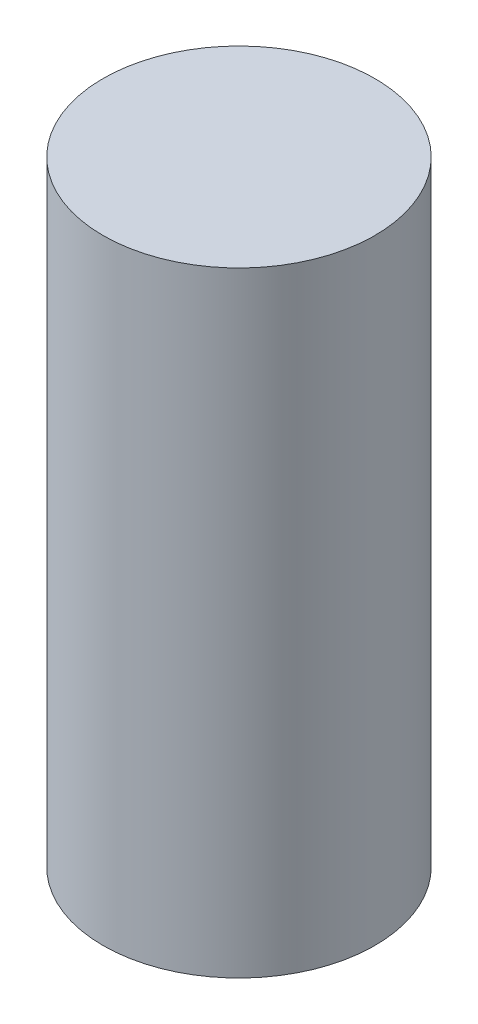
ISO-10303-21;
HEADER;
FILE_DESCRIPTION(('STEP AP214'),'2;1');
FILE_NAME('part.step','',(''),(''),'','','');
FILE_SCHEMA(('AUTOMOTIVE_DESIGN { 1 0 10303 214 1 1 1 1 }'));
ENDSEC;
DATA;
#1=APPLICATION_CONTEXT('core data for automotive mechanical design processes');
#2=APPLICATION_PROTOCOL_DEFINITION('international standard','automotive_design',2000,#1);
#3=PRODUCT_CONTEXT('',#1,'mechanical');
#4=PRODUCT('Part','Part','',(#3));
#5=PRODUCT_RELATED_PRODUCT_CATEGORY('part','',(#4));
#6=PRODUCT_DEFINITION_FORMATION('','',#4);
#7=PRODUCT_DEFINITION_CONTEXT('part definition',#1,'design');
#8=PRODUCT_DEFINITION('design','',#6,#7);
#9=PRODUCT_DEFINITION_SHAPE('','',#8);
#10=(LENGTH_UNIT() NAMED_UNIT(*) SI_UNIT(.MILLI.,.METRE.));
#11=(NAMED_UNIT(*) PLANE_ANGLE_UNIT() SI_UNIT($,.RADIAN.));
#12=(NAMED_UNIT(*) SI_UNIT($,.STERADIAN.) SOLID_ANGLE_UNIT());
#13=UNCERTAINTY_MEASURE_WITH_UNIT(LENGTH_MEASURE(1.E-05),#10,'distance_accuracy_value','');
#14=(GEOMETRIC_REPRESENTATION_CONTEXT(3) GLOBAL_UNCERTAINTY_ASSIGNED_CONTEXT((#13)) GLOBAL_UNIT_ASSIGNED_CONTEXT((#10,
#11,#12)) REPRESENTATION_CONTEXT('',''));
#15=CARTESIAN_POINT('',(0.,0.,0.));
#16=DIRECTION('',(0.,0.,1.));
#17=DIRECTION('',(1.,0.,0.));
#18=AXIS2_PLACEMENT_3D('',#15,#16,#17);
#19=CARTESIAN_POINT('',(0.,17.98,0.));
#20=DIRECTION('',(0.,-1.,0.));
#21=DIRECTION('',(0.,0.,-1.));
#22=AXIS2_PLACEMENT_3D('',#19,#20,#21);
#23=CYLINDRICAL_SURFACE('',#22,3.975);
#24=CARTESIAN_POINT('',(0.,17.98,0.));
#25=DIRECTION('',(0.,1.,0.));
#26=DIRECTION('',(0.,0.,1.));
#27=AXIS2_PLACEMENT_3D('',#24,#25,#26);
#28=CIRCLE('',#27,3.975);
#29=CARTESIAN_POINT('',(0.,17.98,3.975));
#30=VERTEX_POINT('',#29);
#31=EDGE_CURVE('E10',#30,#30,#28,.T.);
#32=ORIENTED_EDGE('',*,*,#31,.F.);
#33=EDGE_LOOP('',(#32));
#34=FACE_BOUND('',#33,.T.);
#35=CARTESIAN_POINT('',(0.,0.,0.));
#36=DIRECTION('',(0.,1.,0.));
#37=DIRECTION('',(0.,0.,1.));
#38=AXIS2_PLACEMENT_3D('',#35,#36,#37);
#39=CIRCLE('',#38,3.975);
#40=CARTESIAN_POINT('',(0.,0.,3.975));
#41=VERTEX_POINT('',#40);
#42=EDGE_CURVE('E33',#41,#41,#39,.T.);
#43=ORIENTED_EDGE('',*,*,#42,.T.);
#44=EDGE_LOOP('',(#43));
#45=FACE_BOUND('',#44,.T.);
#46=ADVANCED_FACE('F30',(#34,#45),#23,.T.);
#47=CARTESIAN_POINT('',(0.,17.98,0.));
#48=DIRECTION('',(0.,1.,0.));
#49=DIRECTION('',(0.,0.,1.));
#50=AXIS2_PLACEMENT_3D('',#47,#48,#49);
#51=PLANE('',#50);
#52=ORIENTED_EDGE('',*,*,#31,.T.);
#53=EDGE_LOOP('',(#52));
#54=FACE_BOUND('',#53,.T.);
#55=ADVANCED_FACE('F45',(#54),#51,.T.);
#56=CARTESIAN_POINT('',(0.,0.,0.));
#57=DIRECTION('',(0.,1.,0.));
#58=DIRECTION('',(0.,0.,1.));
#59=AXIS2_PLACEMENT_3D('',#56,#57,#58);
#60=PLANE('',#59);
#61=ORIENTED_EDGE('',*,*,#42,.F.);
#62=EDGE_LOOP('',(#61));
#63=FACE_BOUND('',#62,.T.);
#64=ADVANCED_FACE('F43',(#63),#60,.F.);
#65=CLOSED_SHELL('',(#46,#55,#64));
#66=MANIFOLD_SOLID_BREP('B2',#65);
#67=ADVANCED_BREP_SHAPE_REPRESENTATION('',(#18,#66),#14);
#68=SHAPE_DEFINITION_REPRESENTATION(#9,#67);
ENDSEC;
END-ISO-10303-21;
